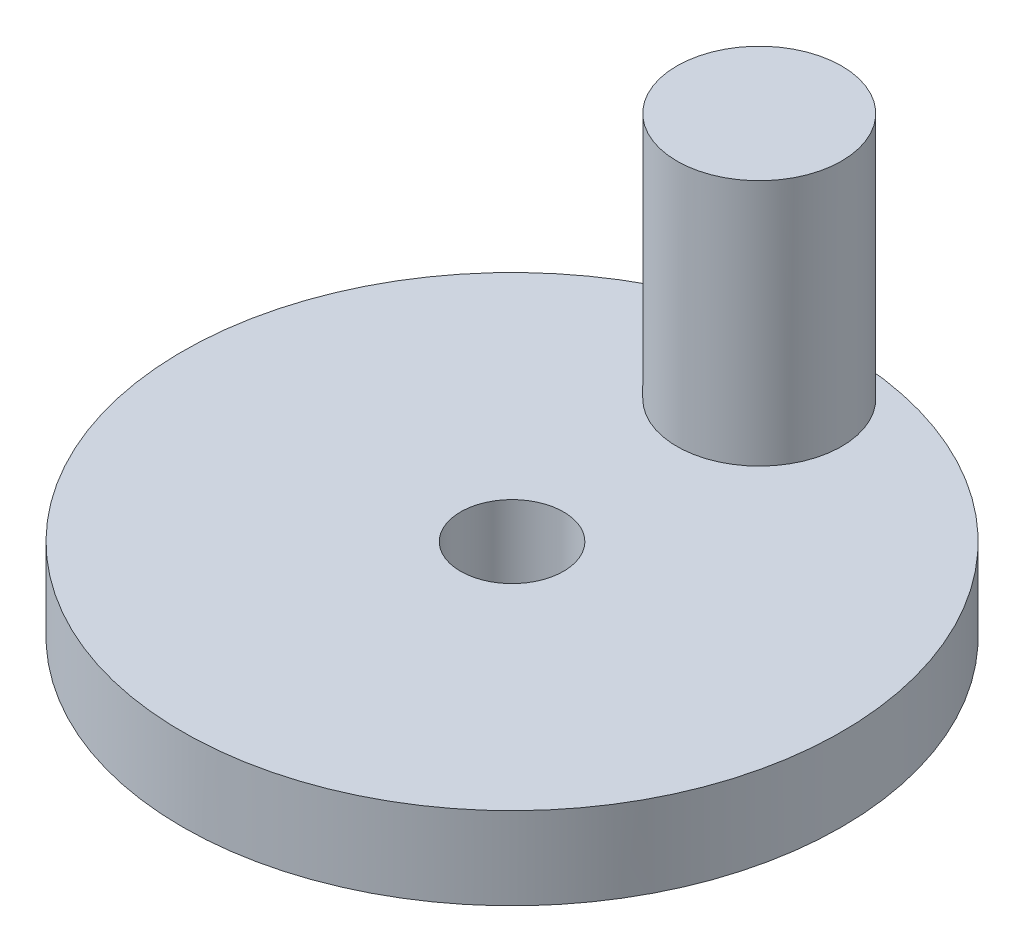
ISO-10303-21;
HEADER;
FILE_DESCRIPTION(('STEP AP214'),'2;1');
FILE_NAME('part.step','',(''),(''),'','','');
FILE_SCHEMA(('AUTOMOTIVE_DESIGN { 1 0 10303 214 1 1 1 1 }'));
ENDSEC;
DATA;
#1=APPLICATION_CONTEXT('core data for automotive mechanical design processes');
#2=APPLICATION_PROTOCOL_DEFINITION('international standard','automotive_design',2000,#1);
#3=PRODUCT_CONTEXT('',#1,'mechanical');
#4=PRODUCT('Part','Part','',(#3));
#5=PRODUCT_RELATED_PRODUCT_CATEGORY('part','',(#4));
#6=PRODUCT_DEFINITION_FORMATION('','',#4);
#7=PRODUCT_DEFINITION_CONTEXT('part definition',#1,'design');
#8=PRODUCT_DEFINITION('design','',#6,#7);
#9=PRODUCT_DEFINITION_SHAPE('','',#8);
#10=(LENGTH_UNIT() NAMED_UNIT(*) SI_UNIT(.MILLI.,.METRE.));
#11=(NAMED_UNIT(*) PLANE_ANGLE_UNIT() SI_UNIT($,.RADIAN.));
#12=(NAMED_UNIT(*) SI_UNIT($,.STERADIAN.) SOLID_ANGLE_UNIT());
#13=UNCERTAINTY_MEASURE_WITH_UNIT(LENGTH_MEASURE(1.E-05),#10,'distance_accuracy_value','');
#14=(GEOMETRIC_REPRESENTATION_CONTEXT(3) GLOBAL_UNCERTAINTY_ASSIGNED_CONTEXT((#13)) GLOBAL_UNIT_ASSIGNED_CONTEXT((#10,
#11,#12)) REPRESENTATION_CONTEXT('',''));
#15=CARTESIAN_POINT('',(0.,0.,0.));
#16=DIRECTION('',(0.,0.,1.));
#17=DIRECTION('',(1.,0.,0.));
#18=AXIS2_PLACEMENT_3D('',#15,#16,#17);
#19=CARTESIAN_POINT('',(0.,2.,0.));
#20=DIRECTION('',(0.,1.,0.));
#21=DIRECTION('',(0.,0.,1.));
#22=AXIS2_PLACEMENT_3D('',#19,#20,#21);
#23=PLANE('',#22);
#24=CARTESIAN_POINT('',(0.,2.,0.));
#25=DIRECTION('',(0.,1.,0.));
#26=DIRECTION('',(0.,0.,1.));
#27=AXIS2_PLACEMENT_3D('',#24,#25,#26);
#28=CIRCLE('',#27,8.);
#29=CARTESIAN_POINT('',(0.,2.,-8.));
#30=VERTEX_POINT('',#29);
#31=EDGE_CURVE('E11',#30,#30,#28,.T.);
#32=ORIENTED_EDGE('',*,*,#31,.T.);
#33=CARTESIAN_POINT('',(0.,2.,-6.));
#34=DIRECTION('',(0.,1.,0.));
#35=DIRECTION('',(0.,0.,1.));
#36=AXIS2_PLACEMENT_3D('',#33,#34,#35);
#37=CIRCLE('',#36,2.);
#38=EDGE_CURVE('E51',#30,#30,#37,.T.);
#39=ORIENTED_EDGE('',*,*,#38,.F.);
#40=EDGE_LOOP('',(#32,#39));
#41=FACE_BOUND('',#40,.T.);
#42=CARTESIAN_POINT('',(0.,2.,0.));
#43=DIRECTION('',(0.,1.,0.));
#44=DIRECTION('',(0.,0.,1.));
#45=AXIS2_PLACEMENT_3D('',#42,#43,#44);
#46=CIRCLE('',#45,1.25);
#47=CARTESIAN_POINT('',(0.,2.,1.25));
#48=VERTEX_POINT('',#47);
#49=EDGE_CURVE('E59',#48,#48,#46,.T.);
#50=ORIENTED_EDGE('',*,*,#49,.F.);
#51=EDGE_LOOP('',(#50));
#52=FACE_BOUND('',#51,.T.);
#53=ADVANCED_FACE('F36',(#41,#52),#23,.T.);
#54=CARTESIAN_POINT('',(0.,0.,0.));
#55=DIRECTION('',(0.,1.,0.));
#56=DIRECTION('',(0.,0.,1.));
#57=AXIS2_PLACEMENT_3D('',#54,#55,#56);
#58=PLANE('',#57);
#59=CARTESIAN_POINT('',(0.,0.,0.));
#60=DIRECTION('',(0.,1.,0.));
#61=DIRECTION('',(0.,0.,1.));
#62=AXIS2_PLACEMENT_3D('',#59,#60,#61);
#63=CIRCLE('',#62,8.);
#64=CARTESIAN_POINT('',(0.,0.,8.));
#65=VERTEX_POINT('',#64);
#66=EDGE_CURVE('E40',#65,#65,#63,.T.);
#67=ORIENTED_EDGE('',*,*,#66,.F.);
#68=EDGE_LOOP('',(#67));
#69=FACE_BOUND('',#68,.T.);
#70=CARTESIAN_POINT('',(0.,0.,0.));
#71=DIRECTION('',(0.,1.,0.));
#72=DIRECTION('',(0.,0.,1.));
#73=AXIS2_PLACEMENT_3D('',#70,#71,#72);
#74=CIRCLE('',#73,1.25);
#75=CARTESIAN_POINT('',(0.,0.,1.25));
#76=VERTEX_POINT('',#75);
#77=EDGE_CURVE('E56',#76,#76,#74,.T.);
#78=ORIENTED_EDGE('',*,*,#77,.T.);
#79=EDGE_LOOP('',(#78));
#80=FACE_BOUND('',#79,.T.);
#81=ADVANCED_FACE('F65',(#69,#80),#58,.F.);
#82=CARTESIAN_POINT('',(0.,2.,0.));
#83=DIRECTION('',(0.,-1.,0.));
#84=DIRECTION('',(0.,0.,-1.));
#85=AXIS2_PLACEMENT_3D('',#82,#83,#84);
#86=CYLINDRICAL_SURFACE('',#85,8.);
#87=ORIENTED_EDGE('',*,*,#31,.F.);
#88=EDGE_LOOP('',(#87));
#89=FACE_BOUND('',#88,.T.);
#90=ORIENTED_EDGE('',*,*,#66,.T.);
#91=EDGE_LOOP('',(#90));
#92=FACE_BOUND('',#91,.T.);
#93=ADVANCED_FACE('F38',(#89,#92),#86,.T.);
#94=CARTESIAN_POINT('',(0.,2.,0.));
#95=DIRECTION('',(0.,-1.,0.));
#96=DIRECTION('',(0.,0.,-1.));
#97=AXIS2_PLACEMENT_3D('',#94,#95,#96);
#98=CYLINDRICAL_SURFACE('',#97,1.25);
#99=ORIENTED_EDGE('',*,*,#49,.T.);
#100=EDGE_LOOP('',(#99));
#101=FACE_BOUND('',#100,.T.);
#102=ORIENTED_EDGE('',*,*,#77,.F.);
#103=EDGE_LOOP('',(#102));
#104=FACE_BOUND('',#103,.T.);
#105=ADVANCED_FACE('F67',(#101,#104),#98,.F.);
#106=CARTESIAN_POINT('',(0.,8.,-6.));
#107=DIRECTION('',(0.,-1.,0.));
#108=DIRECTION('',(0.,0.,-1.));
#109=AXIS2_PLACEMENT_3D('',#106,#107,#108);
#110=CYLINDRICAL_SURFACE('',#109,2.);
#111=CARTESIAN_POINT('',(0.,8.,-6.));
#112=DIRECTION('',(0.,1.,0.));
#113=DIRECTION('',(0.,0.,1.));
#114=AXIS2_PLACEMENT_3D('',#111,#112,#113);
#115=CIRCLE('',#114,2.);
#116=CARTESIAN_POINT('',(0.,8.,-4.));
#117=VERTEX_POINT('',#116);
#118=EDGE_CURVE('E53',#117,#117,#115,.T.);
#119=ORIENTED_EDGE('',*,*,#118,.F.);
#120=EDGE_LOOP('',(#119));
#121=FACE_BOUND('',#120,.T.);
#122=ORIENTED_EDGE('',*,*,#38,.T.);
#123=EDGE_LOOP('',(#122));
#124=FACE_BOUND('',#123,.T.);
#125=ADVANCED_FACE('F69',(#121,#124),#110,.T.);
#126=CARTESIAN_POINT('',(0.,8.,-6.));
#127=DIRECTION('',(0.,1.,0.));
#128=DIRECTION('',(0.,0.,1.));
#129=AXIS2_PLACEMENT_3D('',#126,#127,#128);
#130=PLANE('',#129);
#131=ORIENTED_EDGE('',*,*,#118,.T.);
#132=EDGE_LOOP('',(#131));
#133=FACE_BOUND('',#132,.T.);
#134=ADVANCED_FACE('F76',(#133),#130,.T.);
#135=CLOSED_SHELL('',(#53,#81,#93,#105,#125,#134));
#136=MANIFOLD_SOLID_BREP('B2',#135);
#137=ADVANCED_BREP_SHAPE_REPRESENTATION('',(#18,#136),#14);
#138=SHAPE_DEFINITION_REPRESENTATION(#9,#137);
ENDSEC;
END-ISO-10303-21;
